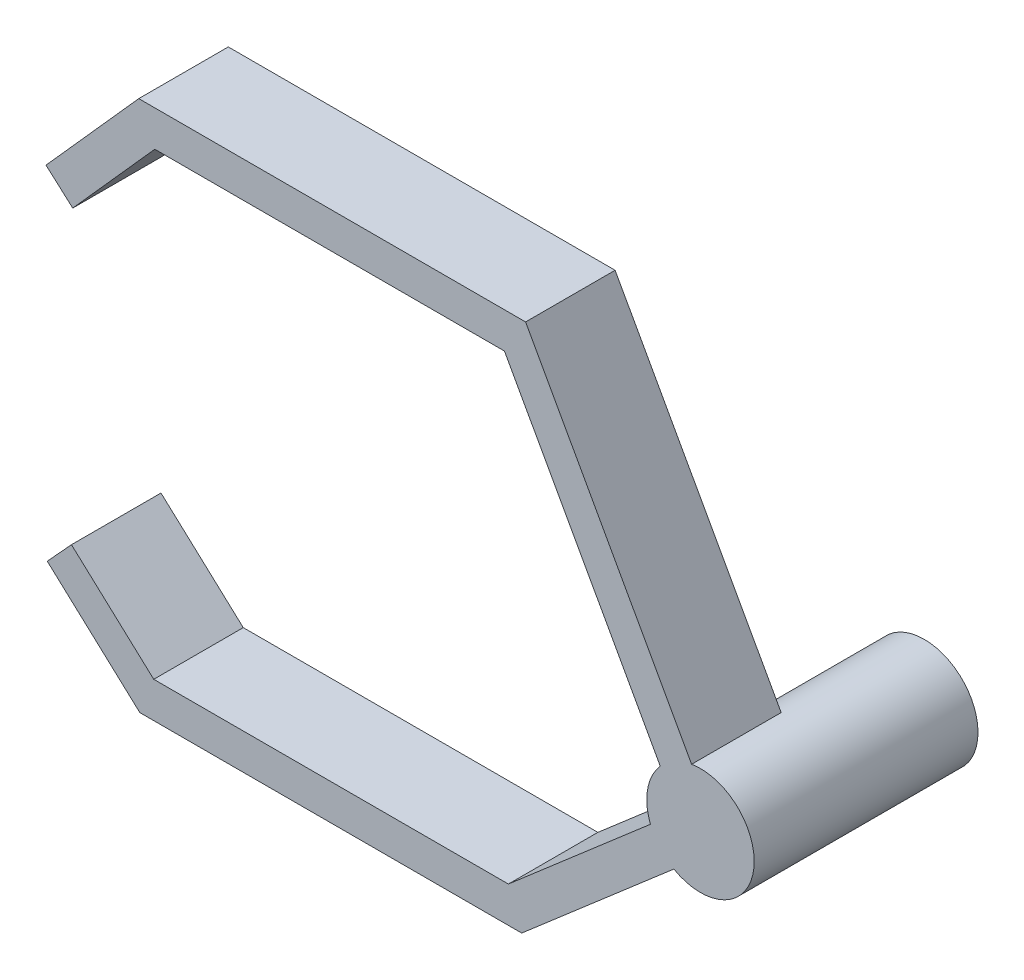
ISO-10303-21;
HEADER;
FILE_DESCRIPTION(('STEP AP214'),'2;1');
FILE_NAME('part.step','',(''),(''),'','','');
FILE_SCHEMA(('AUTOMOTIVE_DESIGN { 1 0 10303 214 1 1 1 1 }'));
ENDSEC;
DATA;
#1=APPLICATION_CONTEXT('core data for automotive mechanical design processes');
#2=APPLICATION_PROTOCOL_DEFINITION('international standard','automotive_design',2000,#1);
#3=PRODUCT_CONTEXT('',#1,'mechanical');
#4=PRODUCT('Part','Part','',(#3));
#5=PRODUCT_RELATED_PRODUCT_CATEGORY('part','',(#4));
#6=PRODUCT_DEFINITION_FORMATION('','',#4);
#7=PRODUCT_DEFINITION_CONTEXT('part definition',#1,'design');
#8=PRODUCT_DEFINITION('design','',#6,#7);
#9=PRODUCT_DEFINITION_SHAPE('','',#8);
#10=(LENGTH_UNIT() NAMED_UNIT(*) SI_UNIT(.MILLI.,.METRE.));
#11=(NAMED_UNIT(*) PLANE_ANGLE_UNIT() SI_UNIT($,.RADIAN.));
#12=(NAMED_UNIT(*) SI_UNIT($,.STERADIAN.) SOLID_ANGLE_UNIT());
#13=UNCERTAINTY_MEASURE_WITH_UNIT(LENGTH_MEASURE(1.E-05),#10,'distance_accuracy_value','');
#14=(GEOMETRIC_REPRESENTATION_CONTEXT(3) GLOBAL_UNCERTAINTY_ASSIGNED_CONTEXT((#13)) GLOBAL_UNIT_ASSIGNED_CONTEXT((#10,
#11,#12)) REPRESENTATION_CONTEXT('',''));
#15=CARTESIAN_POINT('',(0.,0.,0.));
#16=DIRECTION('',(0.,0.,1.));
#17=DIRECTION('',(1.,0.,0.));
#18=AXIS2_PLACEMENT_3D('',#15,#16,#17);
#19=CARTESIAN_POINT('',(0.,0.,0.));
#20=DIRECTION('',(0.,0.,1.));
#21=DIRECTION('',(1.,0.,0.));
#22=AXIS2_PLACEMENT_3D('',#19,#20,#21);
#23=PLANE('',#22);
#24=DIRECTION('',(-0.484174063406623,0.874971700299112,0.));
#25=VECTOR('',#24,1.);
#26=CARTESIAN_POINT('',(1.74994340059822,0.968348126813247,0.));
#27=LINE('',#26,#25);
#28=CARTESIAN_POINT('',(-0.988958707477526,5.91793550783585,0.));
#29=VERTEX_POINT('',#28);
#30=CARTESIAN_POINT('',(-19.5359324816196,39.4349666853925,0.));
#31=VERTEX_POINT('',#30);
#32=EDGE_CURVE('E170',#29,#31,#27,.T.);
#33=ORIENTED_EDGE('',*,*,#32,.F.);
#34=CARTESIAN_POINT('',(0.,0.,0.));
#35=DIRECTION('',(0.,0.,1.));
#36=DIRECTION('',(1.,0.,0.));
#37=AXIS2_PLACEMENT_3D('',#34,#35,#36);
#38=CIRCLE('',#37,6.);
#39=CARTESIAN_POINT('',(-4.48884550867398,3.98123925420936,0.));
#40=VERTEX_POINT('',#39);
#41=EDGE_CURVE('E11',#29,#40,#38,.T.);
#42=ORIENTED_EDGE('',*,*,#41,.T.);
#43=DIRECTION('',(-0.484174063406623,0.874971700299112,0.));
#44=VECTOR('',#43,1.);
#45=CARTESIAN_POINT('',(-1.74994340059822,-0.968348126813247,0.));
#46=LINE('',#45,#44);
#47=CARTESIAN_POINT('',(-21.8940701741508,35.4349666853925,0.));
#48=VERTEX_POINT('',#47);
#49=EDGE_CURVE('E186',#40,#48,#46,.T.);
#50=ORIENTED_EDGE('',*,*,#49,.T.);
#51=DIRECTION('',(-1.,0.,0.));
#52=VECTOR('',#51,1.);
#53=CARTESIAN_POINT('',(0.,35.4349666853925,0.));
#54=LINE('',#53,#52);
#55=CARTESIAN_POINT('',(-60.9529553378539,35.4349666853925,0.));
#56=VERTEX_POINT('',#55);
#57=EDGE_CURVE('E183',#48,#56,#54,.T.);
#58=ORIENTED_EDGE('',*,*,#57,.T.);
#59=DIRECTION('',(-0.665614846958401,-0.746295434468511,0.));
#60=VECTOR('',#59,1.);
#61=CARTESIAN_POINT('',(-51.5503214728992,45.9773137460993,0.));
#62=LINE('',#61,#60);
#63=CARTESIAN_POINT('',(-70.1221280074661,25.1543791467364,0.));
#64=VERTEX_POINT('',#63);
#65=EDGE_CURVE('E180',#56,#64,#62,.T.);
#66=ORIENTED_EDGE('',*,*,#65,.T.);
#67=DIRECTION('',(0.746295434468511,-0.665614846958401,0.));
#68=VECTOR('',#67,1.);
#69=CARTESIAN_POINT('',(-18.5718065345669,-20.8229345993629,0.));
#70=LINE('',#69,#68);
#71=CARTESIAN_POINT('',(-73.1073097453401,27.81683853457,0.));
#72=VERTEX_POINT('',#71);
#73=EDGE_CURVE('E177',#72,#64,#70,.T.);
#74=ORIENTED_EDGE('',*,*,#73,.F.);
#75=DIRECTION('',(-0.665614846958401,-0.746295434468511,0.));
#76=VECTOR('',#75,1.);
#77=CARTESIAN_POINT('',(-54.5355032107733,48.6397731339329,0.));
#78=LINE('',#77,#76);
#79=CARTESIAN_POINT('',(-62.7451954486606,39.4349666853925,0.));
#80=VERTEX_POINT('',#79);
#81=EDGE_CURVE('E175',#80,#72,#78,.T.);
#82=ORIENTED_EDGE('',*,*,#81,.F.);
#83=DIRECTION('',(-1.,0.,0.));
#84=VECTOR('',#83,1.);
#85=CARTESIAN_POINT('',(0.,39.4349666853925,0.));
#86=LINE('',#85,#84);
#87=EDGE_CURVE('E172',#31,#80,#86,.T.);
#88=ORIENTED_EDGE('',*,*,#87,.F.);
#89=EDGE_LOOP('',(#33,#42,#50,#58,#66,#74,#82,#88));
#90=FACE_BOUND('',#89,.T.);
#91=ADVANCED_FACE('F37',(#90),#23,.F.);
#92=CARTESIAN_POINT('',(0.,0.,10.));
#93=DIRECTION('',(0.,0.,-1.));
#94=DIRECTION('',(-1.,0.,0.));
#95=AXIS2_PLACEMENT_3D('',#92,#93,#94);
#96=CYLINDRICAL_SURFACE('',#95,6.);
#97=DIRECTION('',(0.,0.,-1.));
#98=VECTOR('',#97,1.);
#99=CARTESIAN_POINT('',(-2.97205993748859,-5.21218377726413,10.));
#100=LINE('',#99,#98);
#101=CARTESIAN_POINT('',(-2.97205993748859,-5.21218377726413,10.));
#102=VERTEX_POINT('',#101);
#103=CARTESIAN_POINT('',(-2.97205993748859,-5.21218377726413,0.));
#104=VERTEX_POINT('',#103);
#105=EDGE_CURVE('E54',#102,#104,#100,.T.);
#106=ORIENTED_EDGE('',*,*,#105,.T.);
#107=CARTESIAN_POINT('',(-5.58766483466355,-2.1858640615245,0.));
#108=VERTEX_POINT('',#107);
#109=EDGE_CURVE('E41',#108,#104,#38,.T.);
#110=ORIENTED_EDGE('',*,*,#109,.F.);
#111=DIRECTION('',(0.,0.,1.));
#112=VECTOR('',#111,1.);
#113=CARTESIAN_POINT('',(-5.58766483466355,-2.1858640615245,-15.));
#114=LINE('',#113,#112);
#115=CARTESIAN_POINT('',(-5.58766483466355,-2.1858640615245,10.));
#116=VERTEX_POINT('',#115);
#117=EDGE_CURVE('E276',#116,#108,#114,.F.);
#118=ORIENTED_EDGE('',*,*,#117,.F.);
#119=CARTESIAN_POINT('',(0.,0.,10.));
#120=DIRECTION('',(0.,0.,1.));
#121=DIRECTION('',(1.,0.,0.));
#122=AXIS2_PLACEMENT_3D('',#119,#120,#121);
#123=CIRCLE('',#122,6.);
#124=CARTESIAN_POINT('',(-4.48884550867397,3.98123925420936,10.));
#125=VERTEX_POINT('',#124);
#126=EDGE_CURVE('E277',#125,#116,#123,.T.);
#127=ORIENTED_EDGE('',*,*,#126,.F.);
#128=DIRECTION('',(0.,0.,1.));
#129=VECTOR('',#128,1.);
#130=CARTESIAN_POINT('',(-4.48884550867398,3.98123925420936,-15.));
#131=LINE('',#130,#129);
#132=EDGE_CURVE('E173',#125,#40,#131,.F.);
#133=ORIENTED_EDGE('',*,*,#132,.T.);
#134=ORIENTED_EDGE('',*,*,#41,.F.);
#135=DIRECTION('',(0.,0.,-1.));
#136=VECTOR('',#135,1.);
#137=CARTESIAN_POINT('',(-0.988958707477526,5.91793550783585,10.));
#138=LINE('',#137,#136);
#139=CARTESIAN_POINT('',(-0.988958707477526,5.91793550783585,10.));
#140=VERTEX_POINT('',#139);
#141=EDGE_CURVE('E231',#140,#29,#138,.T.);
#142=ORIENTED_EDGE('',*,*,#141,.F.);
#143=CARTESIAN_POINT('',(0.,0.,10.));
#144=DIRECTION('',(0.,0.,1.));
#145=DIRECTION('',(1.,0.,0.));
#146=AXIS2_PLACEMENT_3D('',#143,#144,#145);
#147=CIRCLE('',#146,6.);
#148=EDGE_CURVE('E203',#102,#140,#147,.T.);
#149=ORIENTED_EDGE('',*,*,#148,.F.);
#150=EDGE_LOOP('',(#106,#110,#118,#127,#133,#134,#142,#149));
#151=FACE_BOUND('',#150,.T.);
#152=CARTESIAN_POINT('',(0.,0.,-15.));
#153=DIRECTION('',(0.,0.,1.));
#154=DIRECTION('',(1.,0.,0.));
#155=AXIS2_PLACEMENT_3D('',#152,#153,#154);
#156=CIRCLE('',#155,6.);
#157=CARTESIAN_POINT('',(6.,0.,-15.));
#158=VERTEX_POINT('',#157);
#159=EDGE_CURVE('E275',#158,#158,#156,.T.);
#160=ORIENTED_EDGE('',*,*,#159,.T.);
#161=EDGE_LOOP('',(#160));
#162=FACE_BOUND('',#161,.T.);
#163=ADVANCED_FACE('F39',(#151,#162),#96,.T.);
#164=CARTESIAN_POINT('',(1.74994340059822,0.968348126813247,10.));
#165=DIRECTION('',(-0.874971700299112,-0.484174063406623,0.));
#166=DIRECTION('',(0.484174063406623,-0.874971700299112,0.));
#167=AXIS2_PLACEMENT_3D('',#164,#165,#166);
#168=PLANE('',#167);
#169=ORIENTED_EDGE('',*,*,#32,.T.);
#170=DIRECTION('',(0.,0.,-1.));
#171=VECTOR('',#170,1.);
#172=CARTESIAN_POINT('',(-19.5359324816196,39.4349666853925,10.));
#173=LINE('',#172,#171);
#174=CARTESIAN_POINT('',(-19.5359324816196,39.4349666853925,10.));
#175=VERTEX_POINT('',#174);
#176=EDGE_CURVE('E229',#175,#31,#173,.T.);
#177=ORIENTED_EDGE('',*,*,#176,.F.);
#178=DIRECTION('',(-0.484174063406623,0.874971700299112,0.));
#179=VECTOR('',#178,1.);
#180=CARTESIAN_POINT('',(1.74994340059822,0.968348126813247,10.));
#181=LINE('',#180,#179);
#182=EDGE_CURVE('E112',#140,#175,#181,.T.);
#183=ORIENTED_EDGE('',*,*,#182,.F.);
#184=ORIENTED_EDGE('',*,*,#141,.T.);
#185=EDGE_LOOP('',(#169,#177,#183,#184));
#186=FACE_BOUND('',#185,.T.);
#187=ADVANCED_FACE('F262',(#186),#168,.F.);
#188=CARTESIAN_POINT('',(0.,39.4349666853925,10.));
#189=DIRECTION('',(0.,-1.,0.));
#190=DIRECTION('',(0.,0.,-1.));
#191=AXIS2_PLACEMENT_3D('',#188,#189,#190);
#192=PLANE('',#191);
#193=ORIENTED_EDGE('',*,*,#87,.T.);
#194=DIRECTION('',(0.,0.,-1.));
#195=VECTOR('',#194,1.);
#196=CARTESIAN_POINT('',(-62.7451954486606,39.4349666853925,10.));
#197=LINE('',#196,#195);
#198=CARTESIAN_POINT('',(-62.7451954486606,39.4349666853925,10.));
#199=VERTEX_POINT('',#198);
#200=EDGE_CURVE('E226',#199,#80,#197,.T.);
#201=ORIENTED_EDGE('',*,*,#200,.F.);
#202=DIRECTION('',(-1.,0.,0.));
#203=VECTOR('',#202,1.);
#204=CARTESIAN_POINT('',(0.,39.4349666853925,10.));
#205=LINE('',#204,#203);
#206=EDGE_CURVE('E287',#175,#199,#205,.T.);
#207=ORIENTED_EDGE('',*,*,#206,.F.);
#208=ORIENTED_EDGE('',*,*,#176,.T.);
#209=EDGE_LOOP('',(#193,#201,#207,#208));
#210=FACE_BOUND('',#209,.T.);
#211=ADVANCED_FACE('F342',(#210),#192,.F.);
#212=CARTESIAN_POINT('',(-54.5355032107733,48.6397731339329,10.));
#213=DIRECTION('',(0.746295434468511,-0.665614846958401,0.));
#214=DIRECTION('',(0.665614846958401,0.746295434468511,0.));
#215=AXIS2_PLACEMENT_3D('',#212,#213,#214);
#216=PLANE('',#215);
#217=ORIENTED_EDGE('',*,*,#81,.T.);
#218=DIRECTION('',(0.,0.,-1.));
#219=VECTOR('',#218,1.);
#220=CARTESIAN_POINT('',(-73.1073097453401,27.81683853457,10.));
#221=LINE('',#220,#219);
#222=CARTESIAN_POINT('',(-73.1073097453401,27.81683853457,10.));
#223=VERTEX_POINT('',#222);
#224=EDGE_CURVE('E223',#223,#72,#221,.T.);
#225=ORIENTED_EDGE('',*,*,#224,.F.);
#226=DIRECTION('',(-0.665614846958401,-0.746295434468511,0.));
#227=VECTOR('',#226,1.);
#228=CARTESIAN_POINT('',(-54.5355032107733,48.6397731339329,10.));
#229=LINE('',#228,#227);
#230=EDGE_CURVE('E289',#199,#223,#229,.T.);
#231=ORIENTED_EDGE('',*,*,#230,.F.);
#232=ORIENTED_EDGE('',*,*,#200,.T.);
#233=EDGE_LOOP('',(#217,#225,#231,#232));
#234=FACE_BOUND('',#233,.T.);
#235=ADVANCED_FACE('F349',(#234),#216,.F.);
#236=CARTESIAN_POINT('',(-18.5718065345669,-20.8229345993629,10.));
#237=DIRECTION('',(0.665614846958401,0.746295434468511,0.));
#238=DIRECTION('',(-0.746295434468511,0.665614846958401,0.));
#239=AXIS2_PLACEMENT_3D('',#236,#237,#238);
#240=PLANE('',#239);
#241=ORIENTED_EDGE('',*,*,#73,.T.);
#242=DIRECTION('',(0.,0.,-1.));
#243=VECTOR('',#242,1.);
#244=CARTESIAN_POINT('',(-70.1221280074661,25.1543791467364,10.));
#245=LINE('',#244,#243);
#246=CARTESIAN_POINT('',(-70.1221280074661,25.1543791467364,10.));
#247=VERTEX_POINT('',#246);
#248=EDGE_CURVE('E221',#247,#64,#245,.T.);
#249=ORIENTED_EDGE('',*,*,#248,.F.);
#250=DIRECTION('',(0.746295434468511,-0.665614846958401,0.));
#251=VECTOR('',#250,1.);
#252=CARTESIAN_POINT('',(-18.5718065345669,-20.8229345993629,10.));
#253=LINE('',#252,#251);
#254=EDGE_CURVE('E291',#223,#247,#253,.T.);
#255=ORIENTED_EDGE('',*,*,#254,.F.);
#256=ORIENTED_EDGE('',*,*,#224,.T.);
#257=EDGE_LOOP('',(#241,#249,#255,#256));
#258=FACE_BOUND('',#257,.T.);
#259=ADVANCED_FACE('F351',(#258),#240,.F.);
#260=CARTESIAN_POINT('',(-51.5503214728992,45.9773137460993,10.));
#261=DIRECTION('',(0.746295434468511,-0.665614846958401,0.));
#262=DIRECTION('',(0.665614846958401,0.746295434468511,0.));
#263=AXIS2_PLACEMENT_3D('',#260,#261,#262);
#264=PLANE('',#263);
#265=ORIENTED_EDGE('',*,*,#65,.F.);
#266=DIRECTION('',(0.,0.,-1.));
#267=VECTOR('',#266,1.);
#268=CARTESIAN_POINT('',(-60.9529553378539,35.4349666853925,10.));
#269=LINE('',#268,#267);
#270=CARTESIAN_POINT('',(-60.9529553378539,35.4349666853925,10.));
#271=VERTEX_POINT('',#270);
#272=EDGE_CURVE('E219',#271,#56,#269,.T.);
#273=ORIENTED_EDGE('',*,*,#272,.F.);
#274=DIRECTION('',(-0.665614846958401,-0.746295434468511,0.));
#275=VECTOR('',#274,1.);
#276=CARTESIAN_POINT('',(-51.5503214728992,45.9773137460993,10.));
#277=LINE('',#276,#275);
#278=EDGE_CURVE('E293',#271,#247,#277,.T.);
#279=ORIENTED_EDGE('',*,*,#278,.T.);
#280=ORIENTED_EDGE('',*,*,#248,.T.);
#281=EDGE_LOOP('',(#265,#273,#279,#280));
#282=FACE_BOUND('',#281,.T.);
#283=ADVANCED_FACE('F353',(#282),#264,.T.);
#284=CARTESIAN_POINT('',(0.,35.4349666853925,10.));
#285=DIRECTION('',(0.,-1.,0.));
#286=DIRECTION('',(0.,0.,-1.));
#287=AXIS2_PLACEMENT_3D('',#284,#285,#286);
#288=PLANE('',#287);
#289=ORIENTED_EDGE('',*,*,#57,.F.);
#290=DIRECTION('',(0.,0.,-1.));
#291=VECTOR('',#290,1.);
#292=CARTESIAN_POINT('',(-21.8940701741508,35.4349666853925,10.));
#293=LINE('',#292,#291);
#294=CARTESIAN_POINT('',(-21.8940701741508,35.4349666853925,10.));
#295=VERTEX_POINT('',#294);
#296=EDGE_CURVE('E216',#295,#48,#293,.T.);
#297=ORIENTED_EDGE('',*,*,#296,.F.);
#298=DIRECTION('',(-1.,0.,0.));
#299=VECTOR('',#298,1.);
#300=CARTESIAN_POINT('',(0.,35.4349666853925,10.));
#301=LINE('',#300,#299);
#302=EDGE_CURVE('E296',#295,#271,#301,.T.);
#303=ORIENTED_EDGE('',*,*,#302,.T.);
#304=ORIENTED_EDGE('',*,*,#272,.T.);
#305=EDGE_LOOP('',(#289,#297,#303,#304));
#306=FACE_BOUND('',#305,.T.);
#307=ADVANCED_FACE('F335',(#306),#288,.T.);
#308=CARTESIAN_POINT('',(-1.74994340059822,-0.968348126813247,10.));
#309=DIRECTION('',(-0.874971700299112,-0.484174063406623,0.));
#310=DIRECTION('',(0.484174063406623,-0.874971700299112,0.));
#311=AXIS2_PLACEMENT_3D('',#308,#309,#310);
#312=PLANE('',#311);
#313=ORIENTED_EDGE('',*,*,#132,.F.);
#314=DIRECTION('',(-0.484174063406623,0.874971700299112,0.));
#315=VECTOR('',#314,1.);
#316=CARTESIAN_POINT('',(-1.74994340059822,-0.968348126813247,10.));
#317=LINE('',#316,#315);
#318=EDGE_CURVE('E299',#125,#295,#317,.T.);
#319=ORIENTED_EDGE('',*,*,#318,.T.);
#320=ORIENTED_EDGE('',*,*,#296,.T.);
#321=ORIENTED_EDGE('',*,*,#49,.F.);
#322=EDGE_LOOP('',(#313,#319,#320,#321));
#323=FACE_BOUND('',#322,.T.);
#324=ADVANCED_FACE('F331',(#323),#312,.T.);
#325=CARTESIAN_POINT('',(-1.30780244858748,1.51315985786981,10.));
#326=DIRECTION('',(0.65390122429374,-0.756579928934906,0.));
#327=DIRECTION('',(0.756579928934906,0.65390122429374,0.));
#328=AXIS2_PLACEMENT_3D('',#325,#326,#327);
#329=PLANE('',#328);
#330=DIRECTION('',(-0.756579928934906,-0.65390122429374,0.));
#331=VECTOR('',#330,1.);
#332=CARTESIAN_POINT('',(-1.30780244858748,1.51315985786981,10.));
#333=LINE('',#332,#331);
#334=CARTESIAN_POINT('',(-21.4595176616113,-15.9036797191008,10.));
#335=VERTEX_POINT('',#334);
#336=EDGE_CURVE('E301',#116,#335,#333,.T.);
#337=ORIENTED_EDGE('',*,*,#336,.F.);
#338=ORIENTED_EDGE('',*,*,#117,.T.);
#339=DIRECTION('',(-0.756579928934906,-0.65390122429374,0.));
#340=VECTOR('',#339,1.);
#341=CARTESIAN_POINT('',(-1.30780244858748,1.51315985786981,0.));
#342=LINE('',#341,#340);
#343=CARTESIAN_POINT('',(-21.4595176616113,-15.9036797191008,0.));
#344=VERTEX_POINT('',#343);
#345=EDGE_CURVE('E188',#108,#344,#342,.T.);
#346=ORIENTED_EDGE('',*,*,#345,.T.);
#347=DIRECTION('',(0.,0.,-1.));
#348=VECTOR('',#347,1.);
#349=CARTESIAN_POINT('',(-21.4595176616113,-15.9036797191008,10.));
#350=LINE('',#349,#348);
#351=EDGE_CURVE('E213',#335,#344,#350,.T.);
#352=ORIENTED_EDGE('',*,*,#351,.F.);
#353=EDGE_LOOP('',(#337,#338,#346,#352));
#354=FACE_BOUND('',#353,.T.);
#355=ADVANCED_FACE('F321',(#354),#329,.F.);
#356=CARTESIAN_POINT('',(0.,-15.9036797191008,10.));
#357=DIRECTION('',(0.,-1.,0.));
#358=DIRECTION('',(0.,0.,-1.));
#359=AXIS2_PLACEMENT_3D('',#356,#357,#358);
#360=PLANE('',#359);
#361=DIRECTION('',(-1.,0.,0.));
#362=VECTOR('',#361,1.);
#363=CARTESIAN_POINT('',(0.,-15.9036797191008,0.));
#364=LINE('',#363,#362);
#365=CARTESIAN_POINT('',(-61.0711080121482,-15.9036797191008,0.));
#366=VERTEX_POINT('',#365);
#367=EDGE_CURVE('E190',#344,#366,#364,.T.);
#368=ORIENTED_EDGE('',*,*,#367,.T.);
#369=DIRECTION('',(0.,0.,-1.));
#370=VECTOR('',#369,1.);
#371=CARTESIAN_POINT('',(-61.0711080121482,-15.9036797191008,10.));
#372=LINE('',#371,#370);
#373=CARTESIAN_POINT('',(-61.0711080121482,-15.9036797191008,10.));
#374=VERTEX_POINT('',#373);
#375=EDGE_CURVE('E210',#374,#366,#372,.T.);
#376=ORIENTED_EDGE('',*,*,#375,.F.);
#377=DIRECTION('',(-1.,0.,0.));
#378=VECTOR('',#377,1.);
#379=CARTESIAN_POINT('',(0.,-15.9036797191008,10.));
#380=LINE('',#379,#378);
#381=EDGE_CURVE('E303',#335,#374,#380,.T.);
#382=ORIENTED_EDGE('',*,*,#381,.F.);
#383=ORIENTED_EDGE('',*,*,#351,.T.);
#384=EDGE_LOOP('',(#368,#376,#382,#383));
#385=FACE_BOUND('',#384,.T.);
#386=ADVANCED_FACE('F317',(#385),#360,.F.);
#387=CARTESIAN_POINT('',(-35.8071312920424,-39.0623250458644,10.));
#388=DIRECTION('',(-0.675724628517346,-0.737154140200741,0.));
#389=DIRECTION('',(0.737154140200741,-0.675724628517346,0.));
#390=AXIS2_PLACEMENT_3D('',#387,#388,#389);
#391=PLANE('',#390);
#392=DIRECTION('',(-0.737154140200741,0.675724628517346,0.));
#393=VECTOR('',#392,1.);
#394=CARTESIAN_POINT('',(-35.8071312920424,-39.0623250458644,0.));
#395=LINE('',#394,#393);
#396=CARTESIAN_POINT('',(-70.2632696193684,-7.47753157914891,0.));
#397=VERTEX_POINT('',#396);
#398=EDGE_CURVE('E192',#366,#397,#395,.T.);
#399=ORIENTED_EDGE('',*,*,#398,.T.);
#400=DIRECTION('',(0.,0.,-1.));
#401=VECTOR('',#400,1.);
#402=CARTESIAN_POINT('',(-70.2632696193684,-7.47753157914891,10.));
#403=LINE('',#402,#401);
#404=CARTESIAN_POINT('',(-70.2632696193684,-7.47753157914891,10.));
#405=VERTEX_POINT('',#404);
#406=EDGE_CURVE('E207',#405,#397,#403,.T.);
#407=ORIENTED_EDGE('',*,*,#406,.F.);
#408=DIRECTION('',(-0.737154140200741,0.675724628517346,0.));
#409=VECTOR('',#408,1.);
#410=CARTESIAN_POINT('',(-35.8071312920424,-39.0623250458644,10.));
#411=LINE('',#410,#409);
#412=EDGE_CURVE('E305',#374,#405,#411,.T.);
#413=ORIENTED_EDGE('',*,*,#412,.F.);
#414=ORIENTED_EDGE('',*,*,#375,.T.);
#415=EDGE_LOOP('',(#399,#407,#413,#414));
#416=FACE_BOUND('',#415,.T.);
#417=ADVANCED_FACE('F311',(#416),#391,.F.);
#418=CARTESIAN_POINT('',(-34.4561383273261,31.5847934667155,10.));
#419=DIRECTION('',(0.737154140200742,-0.675724628517346,0.));
#420=DIRECTION('',(0.675724628517346,0.737154140200742,0.));
#421=AXIS2_PLACEMENT_3D('',#418,#419,#420);
#422=PLANE('',#421);
#423=DIRECTION('',(-0.675724628517346,-0.737154140200742,0.));
#424=VECTOR('',#423,1.);
#425=CARTESIAN_POINT('',(-34.4561383273261,31.5847934667155,0.));
#426=LINE('',#425,#424);
#427=CARTESIAN_POINT('',(-72.9661681334378,-10.4261481399519,0.));
#428=VERTEX_POINT('',#427);
#429=EDGE_CURVE('E194',#397,#428,#426,.T.);
#430=ORIENTED_EDGE('',*,*,#429,.T.);
#431=DIRECTION('',(0.,0.,-1.));
#432=VECTOR('',#431,1.);
#433=CARTESIAN_POINT('',(-72.9661681334378,-10.4261481399519,10.));
#434=LINE('',#433,#432);
#435=CARTESIAN_POINT('',(-72.9661681334378,-10.4261481399519,10.));
#436=VERTEX_POINT('',#435);
#437=EDGE_CURVE('E152',#436,#428,#434,.T.);
#438=ORIENTED_EDGE('',*,*,#437,.F.);
#439=DIRECTION('',(-0.675724628517346,-0.737154140200742,0.));
#440=VECTOR('',#439,1.);
#441=CARTESIAN_POINT('',(-34.4561383273261,31.5847934667155,10.));
#442=LINE('',#441,#440);
#443=EDGE_CURVE('E161',#405,#436,#442,.T.);
#444=ORIENTED_EDGE('',*,*,#443,.F.);
#445=ORIENTED_EDGE('',*,*,#406,.T.);
#446=EDGE_LOOP('',(#430,#438,#444,#445));
#447=FACE_BOUND('',#446,.T.);
#448=ADVANCED_FACE('F315',(#447),#422,.F.);
#449=CARTESIAN_POINT('',(-38.5100298061117,-42.0109416066674,10.));
#450=DIRECTION('',(-0.675724628517346,-0.737154140200742,0.));
#451=DIRECTION('',(0.737154140200742,-0.675724628517346,0.));
#452=AXIS2_PLACEMENT_3D('',#449,#450,#451);
#453=PLANE('',#452);
#454=DIRECTION('',(-0.737154140200742,0.675724628517346,0.));
#455=VECTOR('',#454,1.);
#456=CARTESIAN_POINT('',(-38.5100298061117,-42.0109416066674,0.));
#457=LINE('',#456,#455);
#458=CARTESIAN_POINT('',(-62.6270427743662,-19.9036797191008,0.));
#459=VERTEX_POINT('',#458);
#460=EDGE_CURVE('E150',#459,#428,#457,.T.);
#461=ORIENTED_EDGE('',*,*,#460,.F.);
#462=DIRECTION('',(0.,0.,-1.));
#463=VECTOR('',#462,1.);
#464=CARTESIAN_POINT('',(-62.6270427743662,-19.9036797191008,10.));
#465=LINE('',#464,#463);
#466=CARTESIAN_POINT('',(-62.6270427743662,-19.9036797191008,10.));
#467=VERTEX_POINT('',#466);
#468=EDGE_CURVE('E100',#467,#459,#465,.T.);
#469=ORIENTED_EDGE('',*,*,#468,.F.);
#470=DIRECTION('',(-0.737154140200742,0.675724628517346,0.));
#471=VECTOR('',#470,1.);
#472=CARTESIAN_POINT('',(-38.5100298061117,-42.0109416066674,10.));
#473=LINE('',#472,#471);
#474=EDGE_CURVE('E148',#467,#436,#473,.T.);
#475=ORIENTED_EDGE('',*,*,#474,.T.);
#476=ORIENTED_EDGE('',*,*,#437,.T.);
#477=EDGE_LOOP('',(#461,#469,#475,#476));
#478=FACE_BOUND('',#477,.T.);
#479=ADVANCED_FACE('F147',(#478),#453,.T.);
#480=CARTESIAN_POINT('',(0.,-19.9036797191008,10.));
#481=DIRECTION('',(0.,-1.,0.));
#482=DIRECTION('',(0.,0.,-1.));
#483=AXIS2_PLACEMENT_3D('',#480,#481,#482);
#484=PLANE('',#483);
#485=DIRECTION('',(-1.,0.,0.));
#486=VECTOR('',#485,1.);
#487=CARTESIAN_POINT('',(0.,-19.9036797191008,0.));
#488=LINE('',#487,#486);
#489=CARTESIAN_POINT('',(-19.9704849941591,-19.9036797191008,0.));
#490=VERTEX_POINT('',#489);
#491=EDGE_CURVE('E198',#490,#459,#488,.T.);
#492=ORIENTED_EDGE('',*,*,#491,.F.);
#493=DIRECTION('',(0.,0.,-1.));
#494=VECTOR('',#493,1.);
#495=CARTESIAN_POINT('',(-19.9704849941591,-19.9036797191008,10.));
#496=LINE('',#495,#494);
#497=CARTESIAN_POINT('',(-19.9704849941591,-19.9036797191008,10.));
#498=VERTEX_POINT('',#497);
#499=EDGE_CURVE('E104',#498,#490,#496,.T.);
#500=ORIENTED_EDGE('',*,*,#499,.F.);
#501=DIRECTION('',(-1.,0.,0.));
#502=VECTOR('',#501,1.);
#503=CARTESIAN_POINT('',(0.,-19.9036797191008,10.));
#504=LINE('',#503,#502);
#505=EDGE_CURVE('E159',#498,#467,#504,.T.);
#506=ORIENTED_EDGE('',*,*,#505,.T.);
#507=ORIENTED_EDGE('',*,*,#468,.T.);
#508=EDGE_LOOP('',(#492,#500,#506,#507));
#509=FACE_BOUND('',#508,.T.);
#510=ADVANCED_FACE('F164',(#509),#484,.T.);
#511=CARTESIAN_POINT('',(1.30780244858748,-1.51315985786981,10.));
#512=DIRECTION('',(0.65390122429374,-0.756579928934906,0.));
#513=DIRECTION('',(0.756579928934906,0.65390122429374,0.));
#514=AXIS2_PLACEMENT_3D('',#511,#512,#513);
#515=PLANE('',#514);
#516=DIRECTION('',(-0.756579928934906,-0.65390122429374,0.));
#517=VECTOR('',#516,1.);
#518=CARTESIAN_POINT('',(1.30780244858748,-1.51315985786981,0.));
#519=LINE('',#518,#517);
#520=EDGE_CURVE('E200',#104,#490,#519,.T.);
#521=ORIENTED_EDGE('',*,*,#520,.F.);
#522=ORIENTED_EDGE('',*,*,#105,.F.);
#523=DIRECTION('',(-0.756579928934906,-0.65390122429374,0.));
#524=VECTOR('',#523,1.);
#525=CARTESIAN_POINT('',(1.30780244858748,-1.51315985786981,10.));
#526=LINE('',#525,#524);
#527=EDGE_CURVE('E165',#102,#498,#526,.T.);
#528=ORIENTED_EDGE('',*,*,#527,.T.);
#529=ORIENTED_EDGE('',*,*,#499,.T.);
#530=EDGE_LOOP('',(#521,#522,#528,#529));
#531=FACE_BOUND('',#530,.T.);
#532=ADVANCED_FACE('F247',(#531),#515,.T.);
#533=CARTESIAN_POINT('',(0.,0.,10.));
#534=DIRECTION('',(0.,0.,1.));
#535=DIRECTION('',(1.,0.,0.));
#536=AXIS2_PLACEMENT_3D('',#533,#534,#535);
#537=PLANE('',#536);
#538=ORIENTED_EDGE('',*,*,#318,.F.);
#539=ORIENTED_EDGE('',*,*,#126,.T.);
#540=ORIENTED_EDGE('',*,*,#336,.T.);
#541=ORIENTED_EDGE('',*,*,#381,.T.);
#542=ORIENTED_EDGE('',*,*,#412,.T.);
#543=ORIENTED_EDGE('',*,*,#443,.T.);
#544=ORIENTED_EDGE('',*,*,#474,.F.);
#545=ORIENTED_EDGE('',*,*,#505,.F.);
#546=ORIENTED_EDGE('',*,*,#527,.F.);
#547=ORIENTED_EDGE('',*,*,#148,.T.);
#548=ORIENTED_EDGE('',*,*,#182,.T.);
#549=ORIENTED_EDGE('',*,*,#206,.T.);
#550=ORIENTED_EDGE('',*,*,#230,.T.);
#551=ORIENTED_EDGE('',*,*,#254,.T.);
#552=ORIENTED_EDGE('',*,*,#278,.F.);
#553=ORIENTED_EDGE('',*,*,#302,.F.);
#554=EDGE_LOOP('',(#538,#539,#540,#541,#542,#543,#544,#545,#546,#547,#548,#549,#550,#551,#552,#553));
#555=FACE_BOUND('',#554,.T.);
#556=ADVANCED_FACE('F157',(#555),#537,.T.);
#557=ORIENTED_EDGE('',*,*,#345,.F.);
#558=ORIENTED_EDGE('',*,*,#109,.T.);
#559=ORIENTED_EDGE('',*,*,#520,.T.);
#560=ORIENTED_EDGE('',*,*,#491,.T.);
#561=ORIENTED_EDGE('',*,*,#460,.T.);
#562=ORIENTED_EDGE('',*,*,#429,.F.);
#563=ORIENTED_EDGE('',*,*,#398,.F.);
#564=ORIENTED_EDGE('',*,*,#367,.F.);
#565=EDGE_LOOP('',(#557,#558,#559,#560,#561,#562,#563,#564));
#566=FACE_BOUND('',#565,.T.);
#567=ADVANCED_FACE('F238',(#566),#23,.F.);
#568=CARTESIAN_POINT('',(0.,0.,-15.));
#569=DIRECTION('',(0.,0.,1.));
#570=DIRECTION('',(1.,0.,0.));
#571=AXIS2_PLACEMENT_3D('',#568,#569,#570);
#572=PLANE('',#571);
#573=ORIENTED_EDGE('',*,*,#159,.F.);
#574=EDGE_LOOP('',(#573));
#575=FACE_BOUND('',#574,.T.);
#576=ADVANCED_FACE('F265',(#575),#572,.F.);
#577=CLOSED_SHELL('',(#91,#163,#187,#211,#235,#259,#283,#307,#324,#355,#386,#417,#448,#479,#510,
#532,#556,#567,#576));
#578=MANIFOLD_SOLID_BREP('B2',#577);
#579=ADVANCED_BREP_SHAPE_REPRESENTATION('',(#18,#578),#14);
#580=SHAPE_DEFINITION_REPRESENTATION(#9,#579);
ENDSEC;
END-ISO-10303-21;
